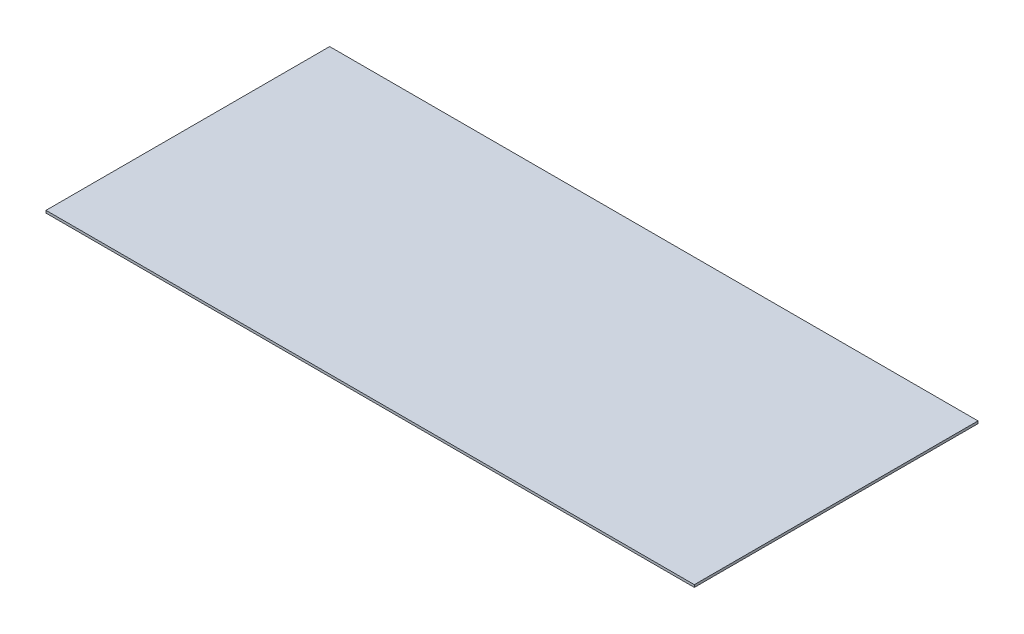
ISO-10303-21;
HEADER;
FILE_DESCRIPTION(('STEP AP214'),'2;1');
FILE_NAME('part.step','',(''),(''),'','','');
FILE_SCHEMA(('AUTOMOTIVE_DESIGN { 1 0 10303 214 1 1 1 1 }'));
ENDSEC;
DATA;
#1=APPLICATION_CONTEXT('core data for automotive mechanical design processes');
#2=APPLICATION_PROTOCOL_DEFINITION('international standard','automotive_design',2000,#1);
#3=PRODUCT_CONTEXT('',#1,'mechanical');
#4=PRODUCT('Part','Part','',(#3));
#5=PRODUCT_RELATED_PRODUCT_CATEGORY('part','',(#4));
#6=PRODUCT_DEFINITION_FORMATION('','',#4);
#7=PRODUCT_DEFINITION_CONTEXT('part definition',#1,'design');
#8=PRODUCT_DEFINITION('design','',#6,#7);
#9=PRODUCT_DEFINITION_SHAPE('','',#8);
#10=(LENGTH_UNIT() NAMED_UNIT(*) SI_UNIT(.MILLI.,.METRE.));
#11=(NAMED_UNIT(*) PLANE_ANGLE_UNIT() SI_UNIT($,.RADIAN.));
#12=(NAMED_UNIT(*) SI_UNIT($,.STERADIAN.) SOLID_ANGLE_UNIT());
#13=UNCERTAINTY_MEASURE_WITH_UNIT(LENGTH_MEASURE(1.E-05),#10,'distance_accuracy_value','');
#14=(GEOMETRIC_REPRESENTATION_CONTEXT(3) GLOBAL_UNCERTAINTY_ASSIGNED_CONTEXT((#13)) GLOBAL_UNIT_ASSIGNED_CONTEXT((#10,
#11,#12)) REPRESENTATION_CONTEXT('',''));
#15=CARTESIAN_POINT('',(0.,0.,0.));
#16=DIRECTION('',(0.,0.,1.));
#17=DIRECTION('',(1.,0.,0.));
#18=AXIS2_PLACEMENT_3D('',#15,#16,#17);
#19=CARTESIAN_POINT('',(400.,3.,175.));
#20=DIRECTION('',(-1.,0.,0.));
#21=DIRECTION('',(0.,0.,1.));
#22=AXIS2_PLACEMENT_3D('',#19,#20,#21);
#23=PLANE('',#22);
#24=DIRECTION('',(0.,0.,-1.));
#25=VECTOR('',#24,1.);
#26=CARTESIAN_POINT('',(400.,0.,175.));
#27=LINE('',#26,#25);
#28=CARTESIAN_POINT('',(400.,0.,175.));
#29=VERTEX_POINT('',#28);
#30=CARTESIAN_POINT('',(400.,0.,-175.));
#31=VERTEX_POINT('',#30);
#32=EDGE_CURVE('E96',#29,#31,#27,.T.);
#33=ORIENTED_EDGE('',*,*,#32,.T.);
#34=DIRECTION('',(0.,-1.,0.));
#35=VECTOR('',#34,1.);
#36=CARTESIAN_POINT('',(400.,3.,-175.));
#37=LINE('',#36,#35);
#38=CARTESIAN_POINT('',(400.,3.,-175.));
#39=VERTEX_POINT('',#38);
#40=EDGE_CURVE('E11',#39,#31,#37,.T.);
#41=ORIENTED_EDGE('',*,*,#40,.F.);
#42=DIRECTION('',(0.,0.,-1.));
#43=VECTOR('',#42,1.);
#44=CARTESIAN_POINT('',(400.,3.,175.));
#45=LINE('',#44,#43);
#46=CARTESIAN_POINT('',(400.,3.,175.));
#47=VERTEX_POINT('',#46);
#48=EDGE_CURVE('E84',#47,#39,#45,.T.);
#49=ORIENTED_EDGE('',*,*,#48,.F.);
#50=DIRECTION('',(0.,-1.,0.));
#51=VECTOR('',#50,1.);
#52=CARTESIAN_POINT('',(400.,3.,175.));
#53=LINE('',#52,#51);
#54=EDGE_CURVE('E92',#47,#29,#53,.T.);
#55=ORIENTED_EDGE('',*,*,#54,.T.);
#56=EDGE_LOOP('',(#33,#41,#49,#55));
#57=FACE_BOUND('',#56,.T.);
#58=ADVANCED_FACE('F33',(#57),#23,.F.);
#59=CARTESIAN_POINT('',(-400.,3.,-175.));
#60=DIRECTION('',(0.,0.,1.));
#61=DIRECTION('',(1.,0.,0.));
#62=AXIS2_PLACEMENT_3D('',#59,#60,#61);
#63=PLANE('',#62);
#64=DIRECTION('',(-1.,0.,0.));
#65=VECTOR('',#64,1.);
#66=CARTESIAN_POINT('',(-400.,0.,-175.));
#67=LINE('',#66,#65);
#68=CARTESIAN_POINT('',(-400.,0.,-175.));
#69=VERTEX_POINT('',#68);
#70=EDGE_CURVE('E88',#31,#69,#67,.T.);
#71=ORIENTED_EDGE('',*,*,#70,.T.);
#72=DIRECTION('',(0.,-1.,0.));
#73=VECTOR('',#72,1.);
#74=CARTESIAN_POINT('',(-400.,3.,-175.));
#75=LINE('',#74,#73);
#76=CARTESIAN_POINT('',(-400.,3.,-175.));
#77=VERTEX_POINT('',#76);
#78=EDGE_CURVE('E41',#77,#69,#75,.T.);
#79=ORIENTED_EDGE('',*,*,#78,.F.);
#80=DIRECTION('',(-1.,0.,0.));
#81=VECTOR('',#80,1.);
#82=CARTESIAN_POINT('',(-400.,3.,-175.));
#83=LINE('',#82,#81);
#84=EDGE_CURVE('E79',#39,#77,#83,.T.);
#85=ORIENTED_EDGE('',*,*,#84,.F.);
#86=ORIENTED_EDGE('',*,*,#40,.T.);
#87=EDGE_LOOP('',(#71,#79,#85,#86));
#88=FACE_BOUND('',#87,.T.);
#89=ADVANCED_FACE('F87',(#88),#63,.F.);
#90=CARTESIAN_POINT('',(-400.,3.,175.));
#91=DIRECTION('',(1.,0.,0.));
#92=DIRECTION('',(0.,0.,-1.));
#93=AXIS2_PLACEMENT_3D('',#90,#91,#92);
#94=PLANE('',#93);
#95=DIRECTION('',(0.,0.,1.));
#96=VECTOR('',#95,1.);
#97=CARTESIAN_POINT('',(-400.,0.,175.));
#98=LINE('',#97,#96);
#99=CARTESIAN_POINT('',(-400.,0.,175.));
#100=VERTEX_POINT('',#99);
#101=EDGE_CURVE('E66',#69,#100,#98,.T.);
#102=ORIENTED_EDGE('',*,*,#101,.T.);
#103=DIRECTION('',(0.,-1.,0.));
#104=VECTOR('',#103,1.);
#105=CARTESIAN_POINT('',(-400.,3.,175.));
#106=LINE('',#105,#104);
#107=CARTESIAN_POINT('',(-400.,3.,175.));
#108=VERTEX_POINT('',#107);
#109=EDGE_CURVE('E89',#108,#100,#106,.T.);
#110=ORIENTED_EDGE('',*,*,#109,.F.);
#111=DIRECTION('',(0.,0.,1.));
#112=VECTOR('',#111,1.);
#113=CARTESIAN_POINT('',(-400.,3.,175.));
#114=LINE('',#113,#112);
#115=EDGE_CURVE('E82',#77,#108,#114,.T.);
#116=ORIENTED_EDGE('',*,*,#115,.F.);
#117=ORIENTED_EDGE('',*,*,#78,.T.);
#118=EDGE_LOOP('',(#102,#110,#116,#117));
#119=FACE_BOUND('',#118,.T.);
#120=ADVANCED_FACE('F90',(#119),#94,.F.);
#121=CARTESIAN_POINT('',(-400.,3.,175.));
#122=DIRECTION('',(0.,0.,-1.));
#123=DIRECTION('',(-1.,0.,0.));
#124=AXIS2_PLACEMENT_3D('',#121,#122,#123);
#125=PLANE('',#124);
#126=DIRECTION('',(1.,0.,0.));
#127=VECTOR('',#126,1.);
#128=CARTESIAN_POINT('',(-400.,0.,175.));
#129=LINE('',#128,#127);
#130=EDGE_CURVE('E72',#100,#29,#129,.T.);
#131=ORIENTED_EDGE('',*,*,#130,.T.);
#132=ORIENTED_EDGE('',*,*,#54,.F.);
#133=DIRECTION('',(1.,0.,0.));
#134=VECTOR('',#133,1.);
#135=CARTESIAN_POINT('',(-400.,3.,175.));
#136=LINE('',#135,#134);
#137=EDGE_CURVE('E49',#108,#47,#136,.T.);
#138=ORIENTED_EDGE('',*,*,#137,.F.);
#139=ORIENTED_EDGE('',*,*,#109,.T.);
#140=EDGE_LOOP('',(#131,#132,#138,#139));
#141=FACE_BOUND('',#140,.T.);
#142=ADVANCED_FACE('F103',(#141),#125,.F.);
#143=CARTESIAN_POINT('',(0.,3.,0.));
#144=DIRECTION('',(0.,-1.,0.));
#145=DIRECTION('',(0.,0.,-1.));
#146=AXIS2_PLACEMENT_3D('',#143,#144,#145);
#147=PLANE('',#146);
#148=ORIENTED_EDGE('',*,*,#48,.T.);
#149=ORIENTED_EDGE('',*,*,#84,.T.);
#150=ORIENTED_EDGE('',*,*,#115,.T.);
#151=ORIENTED_EDGE('',*,*,#137,.T.);
#152=EDGE_LOOP('',(#148,#149,#150,#151));
#153=FACE_BOUND('',#152,.T.);
#154=ADVANCED_FACE('F80',(#153),#147,.F.);
#155=CARTESIAN_POINT('',(0.,0.,0.));
#156=DIRECTION('',(0.,-1.,0.));
#157=DIRECTION('',(0.,0.,-1.));
#158=AXIS2_PLACEMENT_3D('',#155,#156,#157);
#159=PLANE('',#158);
#160=ORIENTED_EDGE('',*,*,#32,.F.);
#161=ORIENTED_EDGE('',*,*,#130,.F.);
#162=ORIENTED_EDGE('',*,*,#101,.F.);
#163=ORIENTED_EDGE('',*,*,#70,.F.);
#164=EDGE_LOOP('',(#160,#161,#162,#163));
#165=FACE_BOUND('',#164,.T.);
#166=ADVANCED_FACE('F106',(#165),#159,.T.);
#167=CLOSED_SHELL('',(#58,#89,#120,#142,#154,#166));
#168=MANIFOLD_SOLID_BREP('B2',#167);
#169=ADVANCED_BREP_SHAPE_REPRESENTATION('',(#18,#168),#14);
#170=SHAPE_DEFINITION_REPRESENTATION(#9,#169);
ENDSEC;
END-ISO-10303-21;
